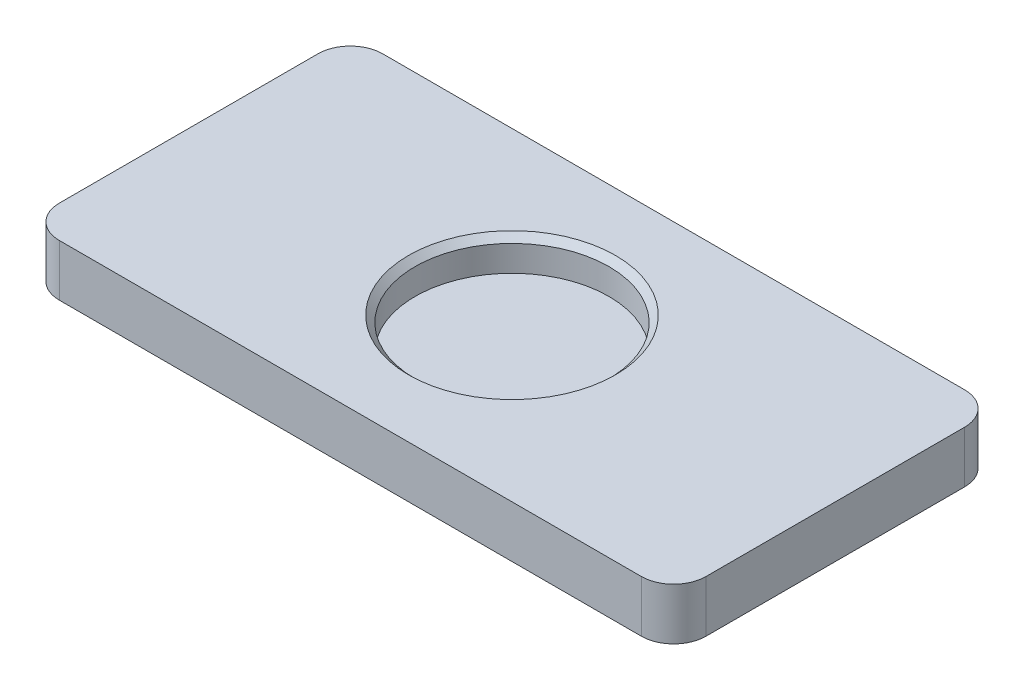
ISO-10303-21;
HEADER;
FILE_DESCRIPTION(('STEP AP214'),'2;1');
FILE_NAME('part.step','',(''),(''),'','','');
FILE_SCHEMA(('AUTOMOTIVE_DESIGN { 1 0 10303 214 1 1 1 1 }'));
ENDSEC;
DATA;
#1=APPLICATION_CONTEXT('core data for automotive mechanical design processes');
#2=APPLICATION_PROTOCOL_DEFINITION('international standard','automotive_design',2000,#1);
#3=PRODUCT_CONTEXT('',#1,'mechanical');
#4=PRODUCT('Part','Part','',(#3));
#5=PRODUCT_RELATED_PRODUCT_CATEGORY('part','',(#4));
#6=PRODUCT_DEFINITION_FORMATION('','',#4);
#7=PRODUCT_DEFINITION_CONTEXT('part definition',#1,'design');
#8=PRODUCT_DEFINITION('design','',#6,#7);
#9=PRODUCT_DEFINITION_SHAPE('','',#8);
#10=(LENGTH_UNIT() NAMED_UNIT(*) SI_UNIT(.MILLI.,.METRE.));
#11=(NAMED_UNIT(*) PLANE_ANGLE_UNIT() SI_UNIT($,.RADIAN.));
#12=(NAMED_UNIT(*) SI_UNIT($,.STERADIAN.) SOLID_ANGLE_UNIT());
#13=UNCERTAINTY_MEASURE_WITH_UNIT(LENGTH_MEASURE(1.E-05),#10,'distance_accuracy_value','');
#14=(GEOMETRIC_REPRESENTATION_CONTEXT(3) GLOBAL_UNCERTAINTY_ASSIGNED_CONTEXT((#13)) GLOBAL_UNIT_ASSIGNED_CONTEXT((#10,
#11,#12)) REPRESENTATION_CONTEXT('',''));
#15=CARTESIAN_POINT('',(0.,0.,0.));
#16=DIRECTION('',(0.,0.,1.));
#17=DIRECTION('',(1.,0.,0.));
#18=AXIS2_PLACEMENT_3D('',#15,#16,#17);
#19=CARTESIAN_POINT('',(25.,4.,-12.5));
#20=DIRECTION('',(-1.,0.,0.));
#21=DIRECTION('',(0.,0.,1.));
#22=AXIS2_PLACEMENT_3D('',#19,#20,#21);
#23=PLANE('',#22);
#24=DIRECTION('',(0.,0.,-1.));
#25=VECTOR('',#24,1.);
#26=CARTESIAN_POINT('',(25.,0.,-12.5));
#27=LINE('',#26,#25);
#28=CARTESIAN_POINT('',(25.,0.,10.));
#29=VERTEX_POINT('',#28);
#30=CARTESIAN_POINT('',(25.,0.,-10.));
#31=VERTEX_POINT('',#30);
#32=EDGE_CURVE('E139',#29,#31,#27,.T.);
#33=ORIENTED_EDGE('',*,*,#32,.T.);
#34=DIRECTION('',(0.,-1.,0.));
#35=VECTOR('',#34,1.);
#36=CARTESIAN_POINT('',(25.,4.,-10.));
#37=LINE('',#36,#35);
#38=CARTESIAN_POINT('',(25.,4.,-10.));
#39=VERTEX_POINT('',#38);
#40=EDGE_CURVE('E166',#31,#39,#37,.F.);
#41=ORIENTED_EDGE('',*,*,#40,.T.);
#42=DIRECTION('',(0.,0.,-1.));
#43=VECTOR('',#42,1.);
#44=CARTESIAN_POINT('',(25.,4.,-12.5));
#45=LINE('',#44,#43);
#46=CARTESIAN_POINT('',(25.,4.,10.));
#47=VERTEX_POINT('',#46);
#48=EDGE_CURVE('E137',#47,#39,#45,.T.);
#49=ORIENTED_EDGE('',*,*,#48,.F.);
#50=DIRECTION('',(0.,-1.,0.));
#51=VECTOR('',#50,1.);
#52=CARTESIAN_POINT('',(25.,4.,10.));
#53=LINE('',#52,#51);
#54=EDGE_CURVE('E163',#47,#29,#53,.T.);
#55=ORIENTED_EDGE('',*,*,#54,.T.);
#56=EDGE_LOOP('',(#33,#41,#49,#55));
#57=FACE_BOUND('',#56,.T.);
#58=ADVANCED_FACE('F41',(#57),#23,.F.);
#59=CARTESIAN_POINT('',(-25.,4.,-12.5));
#60=DIRECTION('',(0.,0.,1.));
#61=DIRECTION('',(1.,0.,0.));
#62=AXIS2_PLACEMENT_3D('',#59,#60,#61);
#63=PLANE('',#62);
#64=DIRECTION('',(-1.,0.,0.));
#65=VECTOR('',#64,1.);
#66=CARTESIAN_POINT('',(-25.,0.,-12.5));
#67=LINE('',#66,#65);
#68=CARTESIAN_POINT('',(22.5,0.,-12.5));
#69=VERTEX_POINT('',#68);
#70=CARTESIAN_POINT('',(-22.5,0.,-12.5));
#71=VERTEX_POINT('',#70);
#72=EDGE_CURVE('E135',#69,#71,#67,.T.);
#73=ORIENTED_EDGE('',*,*,#72,.T.);
#74=DIRECTION('',(0.,-1.,0.));
#75=VECTOR('',#74,1.);
#76=CARTESIAN_POINT('',(-22.5,4.,-12.5));
#77=LINE('',#76,#75);
#78=CARTESIAN_POINT('',(-22.5,4.,-12.5));
#79=VERTEX_POINT('',#78);
#80=EDGE_CURVE('E114',#71,#79,#77,.F.);
#81=ORIENTED_EDGE('',*,*,#80,.T.);
#82=DIRECTION('',(-1.,0.,0.));
#83=VECTOR('',#82,1.);
#84=CARTESIAN_POINT('',(-25.,4.,-12.5));
#85=LINE('',#84,#83);
#86=CARTESIAN_POINT('',(22.5,4.,-12.5));
#87=VERTEX_POINT('',#86);
#88=EDGE_CURVE('E219',#87,#79,#85,.T.);
#89=ORIENTED_EDGE('',*,*,#88,.F.);
#90=DIRECTION('',(0.,-1.,0.));
#91=VECTOR('',#90,1.);
#92=CARTESIAN_POINT('',(22.5,4.,-12.5));
#93=LINE('',#92,#91);
#94=EDGE_CURVE('E119',#87,#69,#93,.T.);
#95=ORIENTED_EDGE('',*,*,#94,.T.);
#96=EDGE_LOOP('',(#73,#81,#89,#95));
#97=FACE_BOUND('',#96,.T.);
#98=ADVANCED_FACE('F184',(#97),#63,.F.);
#99=CARTESIAN_POINT('',(-25.,4.,-12.5));
#100=DIRECTION('',(1.,0.,0.));
#101=DIRECTION('',(0.,0.,-1.));
#102=AXIS2_PLACEMENT_3D('',#99,#100,#101);
#103=PLANE('',#102);
#104=DIRECTION('',(0.,0.,1.));
#105=VECTOR('',#104,1.);
#106=CARTESIAN_POINT('',(-25.,4.,-12.5));
#107=LINE('',#106,#105);
#108=CARTESIAN_POINT('',(-25.,4.,-10.));
#109=VERTEX_POINT('',#108);
#110=CARTESIAN_POINT('',(-25.,4.,10.));
#111=VERTEX_POINT('',#110);
#112=EDGE_CURVE('E128',#109,#111,#107,.T.);
#113=ORIENTED_EDGE('',*,*,#112,.F.);
#114=DIRECTION('',(0.,-1.,0.));
#115=VECTOR('',#114,1.);
#116=CARTESIAN_POINT('',(-25.,4.,-10.));
#117=LINE('',#116,#115);
#118=CARTESIAN_POINT('',(-25.,0.,-10.));
#119=VERTEX_POINT('',#118);
#120=EDGE_CURVE('E113',#109,#119,#117,.T.);
#121=ORIENTED_EDGE('',*,*,#120,.T.);
#122=DIRECTION('',(0.,0.,1.));
#123=VECTOR('',#122,1.);
#124=CARTESIAN_POINT('',(-25.,0.,-12.5));
#125=LINE('',#124,#123);
#126=CARTESIAN_POINT('',(-25.,0.,10.));
#127=VERTEX_POINT('',#126);
#128=EDGE_CURVE('E126',#119,#127,#125,.T.);
#129=ORIENTED_EDGE('',*,*,#128,.T.);
#130=DIRECTION('',(0.,-1.,0.));
#131=VECTOR('',#130,1.);
#132=CARTESIAN_POINT('',(-25.,4.,10.));
#133=LINE('',#132,#131);
#134=EDGE_CURVE('E130',#127,#111,#133,.F.);
#135=ORIENTED_EDGE('',*,*,#134,.T.);
#136=EDGE_LOOP('',(#113,#121,#129,#135));
#137=FACE_BOUND('',#136,.T.);
#138=ADVANCED_FACE('F125',(#137),#103,.F.);
#139=CARTESIAN_POINT('',(-25.,4.,12.5));
#140=DIRECTION('',(0.,0.,-1.));
#141=DIRECTION('',(-1.,0.,0.));
#142=AXIS2_PLACEMENT_3D('',#139,#140,#141);
#143=PLANE('',#142);
#144=DIRECTION('',(1.,0.,0.));
#145=VECTOR('',#144,1.);
#146=CARTESIAN_POINT('',(-25.,4.,12.5));
#147=LINE('',#146,#145);
#148=CARTESIAN_POINT('',(-22.5,4.,12.5));
#149=VERTEX_POINT('',#148);
#150=CARTESIAN_POINT('',(22.5,4.,12.5));
#151=VERTEX_POINT('',#150);
#152=EDGE_CURVE('E143',#149,#151,#147,.T.);
#153=ORIENTED_EDGE('',*,*,#152,.F.);
#154=DIRECTION('',(0.,-1.,0.));
#155=VECTOR('',#154,1.);
#156=CARTESIAN_POINT('',(-22.5,4.,12.5));
#157=LINE('',#156,#155);
#158=CARTESIAN_POINT('',(-22.5,0.,12.5));
#159=VERTEX_POINT('',#158);
#160=EDGE_CURVE('E160',#149,#159,#157,.T.);
#161=ORIENTED_EDGE('',*,*,#160,.T.);
#162=DIRECTION('',(1.,0.,0.));
#163=VECTOR('',#162,1.);
#164=CARTESIAN_POINT('',(-25.,0.,12.5));
#165=LINE('',#164,#163);
#166=CARTESIAN_POINT('',(22.5,0.,12.5));
#167=VERTEX_POINT('',#166);
#168=EDGE_CURVE('E134',#159,#167,#165,.T.);
#169=ORIENTED_EDGE('',*,*,#168,.T.);
#170=DIRECTION('',(0.,-1.,0.));
#171=VECTOR('',#170,1.);
#172=CARTESIAN_POINT('',(22.5,4.,12.5));
#173=LINE('',#172,#171);
#174=EDGE_CURVE('E57',#167,#151,#173,.F.);
#175=ORIENTED_EDGE('',*,*,#174,.T.);
#176=EDGE_LOOP('',(#153,#161,#169,#175));
#177=FACE_BOUND('',#176,.T.);
#178=ADVANCED_FACE('F231',(#177),#143,.F.);
#179=CARTESIAN_POINT('',(0.,4.,0.));
#180=DIRECTION('',(0.,1.,0.));
#181=DIRECTION('',(0.,0.,1.));
#182=AXIS2_PLACEMENT_3D('',#179,#180,#181);
#183=PLANE('',#182);
#184=CARTESIAN_POINT('',(0.,4.,0.));
#185=DIRECTION('',(0.,1.,0.));
#186=DIRECTION('',(0.,0.,1.));
#187=AXIS2_PLACEMENT_3D('',#184,#185,#186);
#188=CIRCLE('',#187,7.99999999999999);
#189=CARTESIAN_POINT('',(0.,4.,7.99999999999999));
#190=VERTEX_POINT('',#189);
#191=EDGE_CURVE('E11',#190,#190,#188,.F.);
#192=ORIENTED_EDGE('',*,*,#191,.T.);
#193=EDGE_LOOP('',(#192));
#194=FACE_BOUND('',#193,.T.);
#195=ORIENTED_EDGE('',*,*,#88,.T.);
#196=CARTESIAN_POINT('',(-22.5,4.,-10.));
#197=DIRECTION('',(0.,1.,0.));
#198=DIRECTION('',(0.,0.,1.));
#199=AXIS2_PLACEMENT_3D('',#196,#197,#198);
#200=CIRCLE('',#199,2.5);
#201=EDGE_CURVE('E157',#79,#109,#200,.T.);
#202=ORIENTED_EDGE('',*,*,#201,.T.);
#203=ORIENTED_EDGE('',*,*,#112,.T.);
#204=CARTESIAN_POINT('',(-22.5,4.,10.));
#205=DIRECTION('',(0.,1.,0.));
#206=DIRECTION('',(0.,0.,1.));
#207=AXIS2_PLACEMENT_3D('',#204,#205,#206);
#208=CIRCLE('',#207,2.5);
#209=EDGE_CURVE('E64',#111,#149,#208,.T.);
#210=ORIENTED_EDGE('',*,*,#209,.T.);
#211=ORIENTED_EDGE('',*,*,#152,.T.);
#212=CARTESIAN_POINT('',(22.5,4.,10.));
#213=DIRECTION('',(0.,1.,0.));
#214=DIRECTION('',(0.,0.,1.));
#215=AXIS2_PLACEMENT_3D('',#212,#213,#214);
#216=CIRCLE('',#215,2.5);
#217=EDGE_CURVE('E152',#151,#47,#216,.T.);
#218=ORIENTED_EDGE('',*,*,#217,.T.);
#219=ORIENTED_EDGE('',*,*,#48,.T.);
#220=CARTESIAN_POINT('',(22.5,4.,-10.));
#221=DIRECTION('',(0.,1.,0.));
#222=DIRECTION('',(0.,0.,1.));
#223=AXIS2_PLACEMENT_3D('',#220,#221,#222);
#224=CIRCLE('',#223,2.5);
#225=EDGE_CURVE('E154',#39,#87,#224,.T.);
#226=ORIENTED_EDGE('',*,*,#225,.T.);
#227=EDGE_LOOP('',(#195,#202,#203,#210,#211,#218,#219,#226));
#228=FACE_BOUND('',#227,.T.);
#229=ADVANCED_FACE('F215',(#194,#228),#183,.T.);
#230=CARTESIAN_POINT('',(0.,0.,0.));
#231=DIRECTION('',(0.,1.,0.));
#232=DIRECTION('',(0.,0.,1.));
#233=AXIS2_PLACEMENT_3D('',#230,#231,#232);
#234=PLANE('',#233);
#235=ORIENTED_EDGE('',*,*,#128,.F.);
#236=CARTESIAN_POINT('',(-22.5,0.,-10.));
#237=DIRECTION('',(0.,1.,0.));
#238=DIRECTION('',(0.,0.,1.));
#239=AXIS2_PLACEMENT_3D('',#236,#237,#238);
#240=CIRCLE('',#239,2.5);
#241=EDGE_CURVE('E109',#119,#71,#240,.F.);
#242=ORIENTED_EDGE('',*,*,#241,.T.);
#243=ORIENTED_EDGE('',*,*,#72,.F.);
#244=CARTESIAN_POINT('',(22.5,0.,-10.));
#245=DIRECTION('',(0.,1.,0.));
#246=DIRECTION('',(0.,0.,1.));
#247=AXIS2_PLACEMENT_3D('',#244,#245,#246);
#248=CIRCLE('',#247,2.5);
#249=EDGE_CURVE('E146',#69,#31,#248,.F.);
#250=ORIENTED_EDGE('',*,*,#249,.T.);
#251=ORIENTED_EDGE('',*,*,#32,.F.);
#252=CARTESIAN_POINT('',(22.5,0.,10.));
#253=DIRECTION('',(0.,1.,0.));
#254=DIRECTION('',(0.,0.,1.));
#255=AXIS2_PLACEMENT_3D('',#252,#253,#254);
#256=CIRCLE('',#255,2.5);
#257=EDGE_CURVE('E129',#29,#167,#256,.F.);
#258=ORIENTED_EDGE('',*,*,#257,.T.);
#259=ORIENTED_EDGE('',*,*,#168,.F.);
#260=CARTESIAN_POINT('',(-22.5,0.,10.));
#261=DIRECTION('',(0.,1.,0.));
#262=DIRECTION('',(0.,0.,1.));
#263=AXIS2_PLACEMENT_3D('',#260,#261,#262);
#264=CIRCLE('',#263,2.5);
#265=EDGE_CURVE('E120',#159,#127,#264,.F.);
#266=ORIENTED_EDGE('',*,*,#265,.T.);
#267=EDGE_LOOP('',(#235,#242,#243,#250,#251,#258,#259,#266));
#268=FACE_BOUND('',#267,.T.);
#269=ADVANCED_FACE('F132',(#268),#234,.F.);
#270=CARTESIAN_POINT('',(-22.5,4.,-10.));
#271=DIRECTION('',(0.,-1.,0.));
#272=DIRECTION('',(0.,0.,-1.));
#273=AXIS2_PLACEMENT_3D('',#270,#271,#272);
#274=CYLINDRICAL_SURFACE('',#273,2.5);
#275=ORIENTED_EDGE('',*,*,#201,.F.);
#276=ORIENTED_EDGE('',*,*,#80,.F.);
#277=ORIENTED_EDGE('',*,*,#241,.F.);
#278=ORIENTED_EDGE('',*,*,#120,.F.);
#279=EDGE_LOOP('',(#275,#276,#277,#278));
#280=FACE_BOUND('',#279,.T.);
#281=ADVANCED_FACE('F112',(#280),#274,.T.);
#282=CARTESIAN_POINT('',(-22.5,4.,10.));
#283=DIRECTION('',(0.,-1.,0.));
#284=DIRECTION('',(0.,0.,-1.));
#285=AXIS2_PLACEMENT_3D('',#282,#283,#284);
#286=CYLINDRICAL_SURFACE('',#285,2.5);
#287=ORIENTED_EDGE('',*,*,#209,.F.);
#288=ORIENTED_EDGE('',*,*,#134,.F.);
#289=ORIENTED_EDGE('',*,*,#265,.F.);
#290=ORIENTED_EDGE('',*,*,#160,.F.);
#291=EDGE_LOOP('',(#287,#288,#289,#290));
#292=FACE_BOUND('',#291,.T.);
#293=ADVANCED_FACE('F197',(#292),#286,.T.);
#294=CARTESIAN_POINT('',(22.5,4.,-10.));
#295=DIRECTION('',(0.,-1.,0.));
#296=DIRECTION('',(0.,0.,-1.));
#297=AXIS2_PLACEMENT_3D('',#294,#295,#296);
#298=CYLINDRICAL_SURFACE('',#297,2.5);
#299=ORIENTED_EDGE('',*,*,#225,.F.);
#300=ORIENTED_EDGE('',*,*,#40,.F.);
#301=ORIENTED_EDGE('',*,*,#249,.F.);
#302=ORIENTED_EDGE('',*,*,#94,.F.);
#303=EDGE_LOOP('',(#299,#300,#301,#302));
#304=FACE_BOUND('',#303,.T.);
#305=ADVANCED_FACE('F200',(#304),#298,.T.);
#306=CARTESIAN_POINT('',(22.5,4.,10.));
#307=DIRECTION('',(0.,-1.,0.));
#308=DIRECTION('',(0.,0.,-1.));
#309=AXIS2_PLACEMENT_3D('',#306,#307,#308);
#310=CYLINDRICAL_SURFACE('',#309,2.5);
#311=ORIENTED_EDGE('',*,*,#217,.F.);
#312=ORIENTED_EDGE('',*,*,#174,.F.);
#313=ORIENTED_EDGE('',*,*,#257,.F.);
#314=ORIENTED_EDGE('',*,*,#54,.F.);
#315=EDGE_LOOP('',(#311,#312,#313,#314));
#316=FACE_BOUND('',#315,.T.);
#317=ADVANCED_FACE('F203',(#316),#310,.T.);
#318=CARTESIAN_POINT('',(0.,1.5,0.));
#319=DIRECTION('',(0.,1.,0.));
#320=DIRECTION('',(0.,0.,1.));
#321=AXIS2_PLACEMENT_3D('',#318,#319,#320);
#322=CYLINDRICAL_SURFACE('',#321,7.5);
#323=CARTESIAN_POINT('',(0.,3.50000000000001,0.));
#324=DIRECTION('',(0.,1.,0.));
#325=DIRECTION('',(0.,0.,1.));
#326=AXIS2_PLACEMENT_3D('',#323,#324,#325);
#327=CIRCLE('',#326,7.5);
#328=CARTESIAN_POINT('',(0.,3.50000000000001,7.5));
#329=VERTEX_POINT('',#328);
#330=EDGE_CURVE('E50',#329,#329,#327,.T.);
#331=ORIENTED_EDGE('',*,*,#330,.T.);
#332=EDGE_LOOP('',(#331));
#333=FACE_BOUND('',#332,.T.);
#334=CARTESIAN_POINT('',(0.,1.5,0.));
#335=DIRECTION('',(0.,1.,0.));
#336=DIRECTION('',(0.,0.,1.));
#337=AXIS2_PLACEMENT_3D('',#334,#335,#336);
#338=CIRCLE('',#337,7.5);
#339=CARTESIAN_POINT('',(0.,1.5,7.5));
#340=VERTEX_POINT('',#339);
#341=EDGE_CURVE('E223',#340,#340,#338,.T.);
#342=ORIENTED_EDGE('',*,*,#341,.F.);
#343=EDGE_LOOP('',(#342));
#344=FACE_BOUND('',#343,.T.);
#345=ADVANCED_FACE('F170',(#333,#344),#322,.F.);
#346=CARTESIAN_POINT('',(0.,1.5,0.));
#347=DIRECTION('',(0.,1.,0.));
#348=DIRECTION('',(0.,0.,1.));
#349=AXIS2_PLACEMENT_3D('',#346,#347,#348);
#350=PLANE('',#349);
#351=ORIENTED_EDGE('',*,*,#341,.T.);
#352=EDGE_LOOP('',(#351));
#353=FACE_BOUND('',#352,.T.);
#354=ADVANCED_FACE('F174',(#353),#350,.T.);
#355=CARTESIAN_POINT('',(0.,3.50000000000001,0.));
#356=DIRECTION('',(0.,1.,0.));
#357=DIRECTION('',(0.,0.,1.));
#358=AXIS2_PLACEMENT_3D('',#355,#356,#357);
#359=CONICAL_SURFACE('',#358,7.5,0.785398163397449);
#360=ORIENTED_EDGE('',*,*,#191,.F.);
#361=EDGE_LOOP('',(#360));
#362=FACE_BOUND('',#361,.T.);
#363=ORIENTED_EDGE('',*,*,#330,.F.);
#364=EDGE_LOOP('',(#363));
#365=FACE_BOUND('',#364,.T.);
#366=ADVANCED_FACE('F44',(#362,#365),#359,.F.);
#367=CLOSED_SHELL('',(#58,#98,#138,#178,#229,#269,#281,#293,#305,#317,#345,#354,#366));
#368=MANIFOLD_SOLID_BREP('B2',#367);
#369=ADVANCED_BREP_SHAPE_REPRESENTATION('',(#18,#368),#14);
#370=SHAPE_DEFINITION_REPRESENTATION(#9,#369);
ENDSEC;
END-ISO-10303-21;
